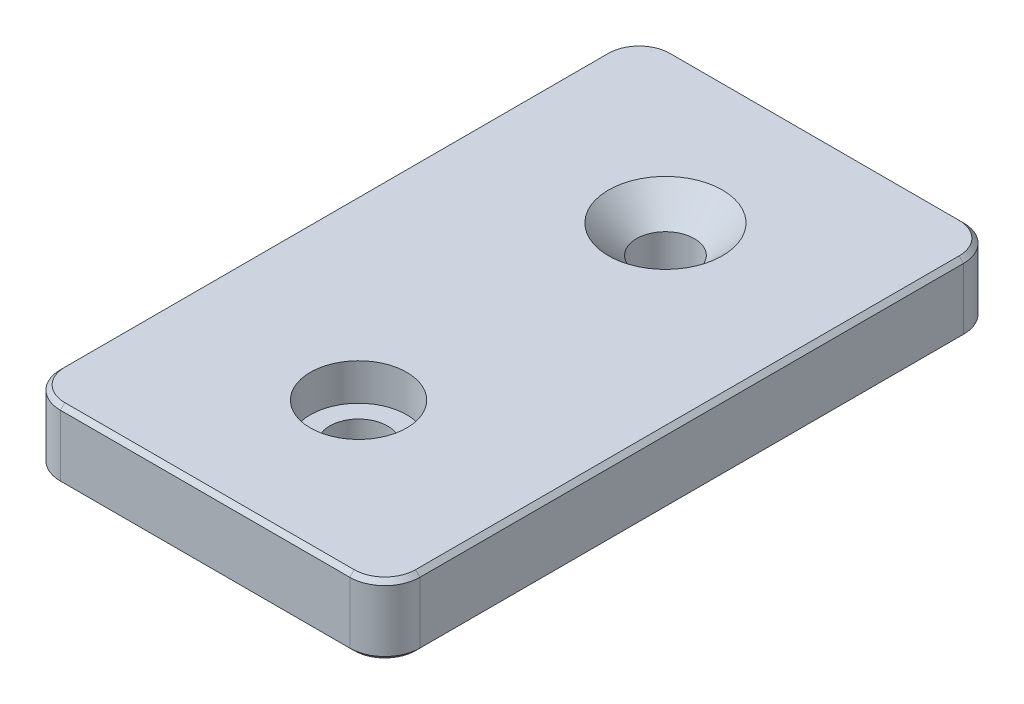
ISO-10303-21;
HEADER;
FILE_DESCRIPTION(('STEP AP214'),'2;1');
FILE_NAME('part.step','',(''),(''),'','','');
FILE_SCHEMA(('AUTOMOTIVE_DESIGN { 1 0 10303 214 1 1 1 1 }'));
ENDSEC;
DATA;
#1=APPLICATION_CONTEXT('core data for automotive mechanical design processes');
#2=APPLICATION_PROTOCOL_DEFINITION('international standard','automotive_design',2000,#1);
#3=PRODUCT_CONTEXT('',#1,'mechanical');
#4=PRODUCT('Part','Part','',(#3));
#5=PRODUCT_RELATED_PRODUCT_CATEGORY('part','',(#4));
#6=PRODUCT_DEFINITION_FORMATION('','',#4);
#7=PRODUCT_DEFINITION_CONTEXT('part definition',#1,'design');
#8=PRODUCT_DEFINITION('design','',#6,#7);
#9=PRODUCT_DEFINITION_SHAPE('','',#8);
#10=(LENGTH_UNIT() NAMED_UNIT(*) SI_UNIT(.MILLI.,.METRE.));
#11=(NAMED_UNIT(*) PLANE_ANGLE_UNIT() SI_UNIT($,.RADIAN.));
#12=(NAMED_UNIT(*) SI_UNIT($,.STERADIAN.) SOLID_ANGLE_UNIT());
#13=UNCERTAINTY_MEASURE_WITH_UNIT(LENGTH_MEASURE(1.E-05),#10,'distance_accuracy_value','');
#14=(GEOMETRIC_REPRESENTATION_CONTEXT(3) GLOBAL_UNCERTAINTY_ASSIGNED_CONTEXT((#13)) GLOBAL_UNIT_ASSIGNED_CONTEXT((#10,
#11,#12)) REPRESENTATION_CONTEXT('',''));
#15=CARTESIAN_POINT('',(0.,0.,0.));
#16=DIRECTION('',(0.,0.,1.));
#17=DIRECTION('',(1.,0.,0.));
#18=AXIS2_PLACEMENT_3D('',#15,#16,#17);
#19=CARTESIAN_POINT('',(0.,8.,17.5));
#20=DIRECTION('',(0.,-1.,0.));
#21=DIRECTION('',(0.,0.,-1.));
#22=AXIS2_PLACEMENT_3D('',#19,#20,#21);
#23=CYLINDRICAL_SURFACE('',#22,3.3);
#24=CARTESIAN_POINT('',(0.,0.,17.5));
#25=DIRECTION('',(0.,1.,0.));
#26=DIRECTION('',(0.,0.,1.));
#27=AXIS2_PLACEMENT_3D('',#24,#25,#26);
#28=CIRCLE('',#27,3.3);
#29=CARTESIAN_POINT('',(0.,0.,20.8));
#30=VERTEX_POINT('',#29);
#31=EDGE_CURVE('E452',#30,#30,#28,.T.);
#32=ORIENTED_EDGE('',*,*,#31,.F.);
#33=EDGE_LOOP('',(#32));
#34=FACE_BOUND('',#33,.T.);
#35=CARTESIAN_POINT('',(0.,3.8,17.5));
#36=DIRECTION('',(0.,1.,0.));
#37=DIRECTION('',(0.,0.,1.));
#38=AXIS2_PLACEMENT_3D('',#35,#36,#37);
#39=CIRCLE('',#38,3.3);
#40=CARTESIAN_POINT('',(0.,3.8,20.8));
#41=VERTEX_POINT('',#40);
#42=EDGE_CURVE('E448',#41,#41,#39,.T.);
#43=ORIENTED_EDGE('',*,*,#42,.T.);
#44=EDGE_LOOP('',(#43));
#45=FACE_BOUND('',#44,.T.);
#46=ADVANCED_FACE('F41',(#34,#45),#23,.F.);
#47=CARTESIAN_POINT('',(0.,8.,0.));
#48=DIRECTION('',(0.,-1.,0.));
#49=DIRECTION('',(0.,0.,-1.));
#50=AXIS2_PLACEMENT_3D('',#47,#48,#49);
#51=PLANE('',#50);
#52=CARTESIAN_POINT('',(-16.5,8.,-31.));
#53=DIRECTION('',(0.,-1.,0.));
#54=DIRECTION('',(0.,0.,-1.));
#55=AXIS2_PLACEMENT_3D('',#52,#53,#54);
#56=CIRCLE('',#55,3.50000000000001);
#57=CARTESIAN_POINT('',(-16.5,8.,-34.5));
#58=VERTEX_POINT('',#57);
#59=CARTESIAN_POINT('',(-20.,8.,-31.));
#60=VERTEX_POINT('',#59);
#61=EDGE_CURVE('E283',#58,#60,#56,.F.);
#62=ORIENTED_EDGE('',*,*,#61,.T.);
#63=DIRECTION('',(0.,0.,1.));
#64=VECTOR('',#63,1.);
#65=CARTESIAN_POINT('',(-20.,8.,0.));
#66=LINE('',#65,#64);
#67=CARTESIAN_POINT('',(-20.,8.,31.));
#68=VERTEX_POINT('',#67);
#69=EDGE_CURVE('E11',#60,#68,#66,.T.);
#70=ORIENTED_EDGE('',*,*,#69,.T.);
#71=CARTESIAN_POINT('',(-16.5,8.,31.));
#72=DIRECTION('',(0.,-1.,0.));
#73=DIRECTION('',(0.,0.,-1.));
#74=AXIS2_PLACEMENT_3D('',#71,#72,#73);
#75=CIRCLE('',#74,3.50000000000001);
#76=CARTESIAN_POINT('',(-16.5,8.,34.5));
#77=VERTEX_POINT('',#76);
#78=EDGE_CURVE('E52',#68,#77,#75,.F.);
#79=ORIENTED_EDGE('',*,*,#78,.T.);
#80=DIRECTION('',(1.,0.,0.));
#81=VECTOR('',#80,1.);
#82=CARTESIAN_POINT('',(0.,8.,34.5));
#83=LINE('',#82,#81);
#84=CARTESIAN_POINT('',(16.5,8.,34.5));
#85=VERTEX_POINT('',#84);
#86=EDGE_CURVE('E298',#77,#85,#83,.T.);
#87=ORIENTED_EDGE('',*,*,#86,.T.);
#88=CARTESIAN_POINT('',(16.5,8.,31.));
#89=DIRECTION('',(0.,-1.,0.));
#90=DIRECTION('',(0.,0.,-1.));
#91=AXIS2_PLACEMENT_3D('',#88,#89,#90);
#92=CIRCLE('',#91,3.50000000000001);
#93=CARTESIAN_POINT('',(20.,8.,31.));
#94=VERTEX_POINT('',#93);
#95=EDGE_CURVE('E295',#85,#94,#92,.F.);
#96=ORIENTED_EDGE('',*,*,#95,.T.);
#97=DIRECTION('',(0.,0.,-1.));
#98=VECTOR('',#97,1.);
#99=CARTESIAN_POINT('',(20.,8.,0.));
#100=LINE('',#99,#98);
#101=CARTESIAN_POINT('',(20.,8.,-31.));
#102=VERTEX_POINT('',#101);
#103=EDGE_CURVE('E292',#94,#102,#100,.T.);
#104=ORIENTED_EDGE('',*,*,#103,.T.);
#105=CARTESIAN_POINT('',(16.5,8.,-31.));
#106=DIRECTION('',(0.,-1.,0.));
#107=DIRECTION('',(0.,0.,-1.));
#108=AXIS2_PLACEMENT_3D('',#105,#106,#107);
#109=CIRCLE('',#108,3.50000000000001);
#110=CARTESIAN_POINT('',(16.5,8.,-34.5));
#111=VERTEX_POINT('',#110);
#112=EDGE_CURVE('E289',#102,#111,#109,.F.);
#113=ORIENTED_EDGE('',*,*,#112,.T.);
#114=DIRECTION('',(-1.,0.,0.));
#115=VECTOR('',#114,1.);
#116=CARTESIAN_POINT('',(0.,8.,-34.5));
#117=LINE('',#116,#115);
#118=EDGE_CURVE('E286',#111,#58,#117,.T.);
#119=ORIENTED_EDGE('',*,*,#118,.T.);
#120=EDGE_LOOP('',(#62,#70,#79,#87,#96,#104,#113,#119));
#121=FACE_BOUND('',#120,.T.);
#122=CARTESIAN_POINT('',(0.,8.,-17.5));
#123=DIRECTION('',(0.,-1.,0.));
#124=DIRECTION('',(0.,0.,-1.));
#125=AXIS2_PLACEMENT_3D('',#122,#123,#124);
#126=CIRCLE('',#125,6.50000000000001);
#127=CARTESIAN_POINT('',(0.,8.,-24.));
#128=VERTEX_POINT('',#127);
#129=EDGE_CURVE('E437',#128,#128,#126,.T.);
#130=ORIENTED_EDGE('',*,*,#129,.T.);
#131=EDGE_LOOP('',(#130));
#132=FACE_BOUND('',#131,.T.);
#133=CARTESIAN_POINT('',(0.,8.,17.5));
#134=DIRECTION('',(0.,1.,0.));
#135=DIRECTION('',(0.,0.,1.));
#136=AXIS2_PLACEMENT_3D('',#133,#134,#135);
#137=CIRCLE('',#136,5.5);
#138=CARTESIAN_POINT('',(0.,8.,23.));
#139=VERTEX_POINT('',#138);
#140=EDGE_CURVE('E327',#139,#139,#137,.T.);
#141=ORIENTED_EDGE('',*,*,#140,.F.);
#142=EDGE_LOOP('',(#141));
#143=FACE_BOUND('',#142,.T.);
#144=ADVANCED_FACE('F425',(#121,#132,#143),#51,.F.);
#145=CARTESIAN_POINT('',(0.,0.,0.));
#146=DIRECTION('',(0.,-1.,0.));
#147=DIRECTION('',(0.,0.,-1.));
#148=AXIS2_PLACEMENT_3D('',#145,#146,#147);
#149=PLANE('',#148);
#150=CARTESIAN_POINT('',(-16.5,0.,31.));
#151=DIRECTION('',(0.,-1.,0.));
#152=DIRECTION('',(0.,0.,-1.));
#153=AXIS2_PLACEMENT_3D('',#150,#151,#152);
#154=CIRCLE('',#153,3.5);
#155=CARTESIAN_POINT('',(-16.5,0.,34.5));
#156=VERTEX_POINT('',#155);
#157=CARTESIAN_POINT('',(-20.,0.,31.));
#158=VERTEX_POINT('',#157);
#159=EDGE_CURVE('E241',#156,#158,#154,.T.);
#160=ORIENTED_EDGE('',*,*,#159,.T.);
#161=DIRECTION('',(0.,0.,-1.));
#162=VECTOR('',#161,1.);
#163=CARTESIAN_POINT('',(-20.,0.,-31.));
#164=LINE('',#163,#162);
#165=CARTESIAN_POINT('',(-20.,0.,-31.));
#166=VERTEX_POINT('',#165);
#167=EDGE_CURVE('E165',#158,#166,#164,.T.);
#168=ORIENTED_EDGE('',*,*,#167,.T.);
#169=CARTESIAN_POINT('',(-16.5,0.,-31.));
#170=DIRECTION('',(0.,-1.,0.));
#171=DIRECTION('',(0.,0.,-1.));
#172=AXIS2_PLACEMENT_3D('',#169,#170,#171);
#173=CIRCLE('',#172,3.5);
#174=CARTESIAN_POINT('',(-16.5,0.,-34.5));
#175=VERTEX_POINT('',#174);
#176=EDGE_CURVE('E229',#166,#175,#173,.T.);
#177=ORIENTED_EDGE('',*,*,#176,.T.);
#178=DIRECTION('',(1.,0.,0.));
#179=VECTOR('',#178,1.);
#180=CARTESIAN_POINT('',(16.5,0.,-34.5));
#181=LINE('',#180,#179);
#182=CARTESIAN_POINT('',(16.5,0.,-34.5));
#183=VERTEX_POINT('',#182);
#184=EDGE_CURVE('E194',#175,#183,#181,.T.);
#185=ORIENTED_EDGE('',*,*,#184,.T.);
#186=CARTESIAN_POINT('',(16.5,0.,-31.));
#187=DIRECTION('',(0.,-1.,0.));
#188=DIRECTION('',(0.,0.,-1.));
#189=AXIS2_PLACEMENT_3D('',#186,#187,#188);
#190=CIRCLE('',#189,3.5);
#191=CARTESIAN_POINT('',(20.,0.,-31.));
#192=VERTEX_POINT('',#191);
#193=EDGE_CURVE('E226',#183,#192,#190,.T.);
#194=ORIENTED_EDGE('',*,*,#193,.T.);
#195=DIRECTION('',(0.,0.,1.));
#196=VECTOR('',#195,1.);
#197=CARTESIAN_POINT('',(20.,0.,31.));
#198=LINE('',#197,#196);
#199=CARTESIAN_POINT('',(20.,0.,31.));
#200=VERTEX_POINT('',#199);
#201=EDGE_CURVE('E232',#192,#200,#198,.T.);
#202=ORIENTED_EDGE('',*,*,#201,.T.);
#203=CARTESIAN_POINT('',(16.5,0.,31.));
#204=DIRECTION('',(0.,-1.,0.));
#205=DIRECTION('',(0.,0.,-1.));
#206=AXIS2_PLACEMENT_3D('',#203,#204,#205);
#207=CIRCLE('',#206,3.5);
#208=CARTESIAN_POINT('',(16.5,0.,34.5));
#209=VERTEX_POINT('',#208);
#210=EDGE_CURVE('E235',#200,#209,#207,.T.);
#211=ORIENTED_EDGE('',*,*,#210,.T.);
#212=DIRECTION('',(-1.,0.,0.));
#213=VECTOR('',#212,1.);
#214=CARTESIAN_POINT('',(-16.5,0.,34.5));
#215=LINE('',#214,#213);
#216=EDGE_CURVE('E238',#209,#156,#215,.T.);
#217=ORIENTED_EDGE('',*,*,#216,.T.);
#218=EDGE_LOOP('',(#160,#168,#177,#185,#194,#202,#211,#217));
#219=FACE_BOUND('',#218,.T.);
#220=CARTESIAN_POINT('',(0.,0.,-17.5));
#221=DIRECTION('',(0.,1.,0.));
#222=DIRECTION('',(0.,0.,1.));
#223=AXIS2_PLACEMENT_3D('',#220,#221,#222);
#224=CIRCLE('',#223,3.3);
#225=CARTESIAN_POINT('',(0.,0.,-14.2));
#226=VERTEX_POINT('',#225);
#227=EDGE_CURVE('E447',#226,#226,#224,.T.);
#228=ORIENTED_EDGE('',*,*,#227,.T.);
#229=EDGE_LOOP('',(#228));
#230=FACE_BOUND('',#229,.T.);
#231=ORIENTED_EDGE('',*,*,#31,.T.);
#232=EDGE_LOOP('',(#231));
#233=FACE_BOUND('',#232,.T.);
#234=ADVANCED_FACE('F387',(#219,#230,#233),#149,.T.);
#235=CARTESIAN_POINT('',(20.5,8.,35.));
#236=DIRECTION('',(-1.,0.,0.));
#237=DIRECTION('',(0.,0.,1.));
#238=AXIS2_PLACEMENT_3D('',#235,#236,#237);
#239=PLANE('',#238);
#240=DIRECTION('',(0.,-1.,0.));
#241=VECTOR('',#240,1.);
#242=CARTESIAN_POINT('',(20.5,8.,31.));
#243=LINE('',#242,#241);
#244=CARTESIAN_POINT('',(20.5,7.5,31.));
#245=VERTEX_POINT('',#244);
#246=CARTESIAN_POINT('',(20.5,0.5,31.));
#247=VERTEX_POINT('',#246);
#248=EDGE_CURVE('E205',#245,#247,#243,.T.);
#249=ORIENTED_EDGE('',*,*,#248,.T.);
#250=DIRECTION('',(0.,0.,-1.));
#251=VECTOR('',#250,1.);
#252=CARTESIAN_POINT('',(20.5,0.5,-31.));
#253=LINE('',#252,#251);
#254=CARTESIAN_POINT('',(20.5,0.5,-31.));
#255=VERTEX_POINT('',#254);
#256=EDGE_CURVE('E262',#247,#255,#253,.T.);
#257=ORIENTED_EDGE('',*,*,#256,.T.);
#258=DIRECTION('',(0.,-1.,0.));
#259=VECTOR('',#258,1.);
#260=CARTESIAN_POINT('',(20.5,8.,-31.));
#261=LINE('',#260,#259);
#262=CARTESIAN_POINT('',(20.5,7.5,-31.));
#263=VERTEX_POINT('',#262);
#264=EDGE_CURVE('E200',#255,#263,#261,.F.);
#265=ORIENTED_EDGE('',*,*,#264,.T.);
#266=DIRECTION('',(0.,0.,1.));
#267=VECTOR('',#266,1.);
#268=CARTESIAN_POINT('',(20.5,7.5,35.));
#269=LINE('',#268,#267);
#270=EDGE_CURVE('E259',#263,#245,#269,.T.);
#271=ORIENTED_EDGE('',*,*,#270,.T.);
#272=EDGE_LOOP('',(#249,#257,#265,#271));
#273=FACE_BOUND('',#272,.T.);
#274=ADVANCED_FACE('F368',(#273),#239,.F.);
#275=CARTESIAN_POINT('',(-20.5,8.,-35.));
#276=DIRECTION('',(0.,0.,1.));
#277=DIRECTION('',(1.,0.,0.));
#278=AXIS2_PLACEMENT_3D('',#275,#276,#277);
#279=PLANE('',#278);
#280=DIRECTION('',(0.,-1.,0.));
#281=VECTOR('',#280,1.);
#282=CARTESIAN_POINT('',(16.5,8.,-35.));
#283=LINE('',#282,#281);
#284=CARTESIAN_POINT('',(16.5,7.5,-35.));
#285=VERTEX_POINT('',#284);
#286=CARTESIAN_POINT('',(16.5,0.5,-35.));
#287=VERTEX_POINT('',#286);
#288=EDGE_CURVE('E218',#285,#287,#283,.T.);
#289=ORIENTED_EDGE('',*,*,#288,.T.);
#290=DIRECTION('',(-1.,0.,0.));
#291=VECTOR('',#290,1.);
#292=CARTESIAN_POINT('',(-16.5,0.5,-35.));
#293=LINE('',#292,#291);
#294=CARTESIAN_POINT('',(-16.5,0.5,-35.));
#295=VERTEX_POINT('',#294);
#296=EDGE_CURVE('E280',#287,#295,#293,.T.);
#297=ORIENTED_EDGE('',*,*,#296,.T.);
#298=DIRECTION('',(0.,-1.,0.));
#299=VECTOR('',#298,1.);
#300=CARTESIAN_POINT('',(-16.5,8.,-35.));
#301=LINE('',#300,#299);
#302=CARTESIAN_POINT('',(-16.5,7.5,-35.));
#303=VERTEX_POINT('',#302);
#304=EDGE_CURVE('E214',#295,#303,#301,.F.);
#305=ORIENTED_EDGE('',*,*,#304,.T.);
#306=DIRECTION('',(1.,0.,0.));
#307=VECTOR('',#306,1.);
#308=CARTESIAN_POINT('',(-20.5,7.5,-35.));
#309=LINE('',#308,#307);
#310=EDGE_CURVE('E277',#303,#285,#309,.T.);
#311=ORIENTED_EDGE('',*,*,#310,.T.);
#312=EDGE_LOOP('',(#289,#297,#305,#311));
#313=FACE_BOUND('',#312,.T.);
#314=ADVANCED_FACE('F400',(#313),#279,.F.);
#315=CARTESIAN_POINT('',(-20.5,8.,35.));
#316=DIRECTION('',(1.,0.,0.));
#317=DIRECTION('',(0.,0.,-1.));
#318=AXIS2_PLACEMENT_3D('',#315,#316,#317);
#319=PLANE('',#318);
#320=DIRECTION('',(0.,-1.,0.));
#321=VECTOR('',#320,1.);
#322=CARTESIAN_POINT('',(-20.5,8.,-31.));
#323=LINE('',#322,#321);
#324=CARTESIAN_POINT('',(-20.5,7.5,-31.));
#325=VERTEX_POINT('',#324);
#326=CARTESIAN_POINT('',(-20.5,0.5,-31.));
#327=VERTEX_POINT('',#326);
#328=EDGE_CURVE('E191',#325,#327,#323,.T.);
#329=ORIENTED_EDGE('',*,*,#328,.T.);
#330=DIRECTION('',(0.,0.,1.));
#331=VECTOR('',#330,1.);
#332=CARTESIAN_POINT('',(-20.5,0.5,31.));
#333=LINE('',#332,#331);
#334=CARTESIAN_POINT('',(-20.5,0.5,31.));
#335=VERTEX_POINT('',#334);
#336=EDGE_CURVE('E163',#327,#335,#333,.T.);
#337=ORIENTED_EDGE('',*,*,#336,.T.);
#338=DIRECTION('',(0.,-1.,0.));
#339=VECTOR('',#338,1.);
#340=CARTESIAN_POINT('',(-20.5,8.,31.));
#341=LINE('',#340,#339);
#342=CARTESIAN_POINT('',(-20.5,7.5,31.));
#343=VERTEX_POINT('',#342);
#344=EDGE_CURVE('E189',#335,#343,#341,.F.);
#345=ORIENTED_EDGE('',*,*,#344,.T.);
#346=DIRECTION('',(0.,0.,-1.));
#347=VECTOR('',#346,1.);
#348=CARTESIAN_POINT('',(-20.5,7.5,35.));
#349=LINE('',#348,#347);
#350=EDGE_CURVE('E195',#343,#325,#349,.T.);
#351=ORIENTED_EDGE('',*,*,#350,.T.);
#352=EDGE_LOOP('',(#329,#337,#345,#351));
#353=FACE_BOUND('',#352,.T.);
#354=ADVANCED_FACE('F187',(#353),#319,.F.);
#355=CARTESIAN_POINT('',(-20.5,8.,35.));
#356=DIRECTION('',(0.,0.,-1.));
#357=DIRECTION('',(-1.,0.,0.));
#358=AXIS2_PLACEMENT_3D('',#355,#356,#357);
#359=PLANE('',#358);
#360=DIRECTION('',(0.,-1.,0.));
#361=VECTOR('',#360,1.);
#362=CARTESIAN_POINT('',(-16.5,8.,35.));
#363=LINE('',#362,#361);
#364=CARTESIAN_POINT('',(-16.5,7.5,35.));
#365=VERTEX_POINT('',#364);
#366=CARTESIAN_POINT('',(-16.5,0.5,35.));
#367=VERTEX_POINT('',#366);
#368=EDGE_CURVE('E207',#365,#367,#363,.T.);
#369=ORIENTED_EDGE('',*,*,#368,.T.);
#370=DIRECTION('',(1.,0.,0.));
#371=VECTOR('',#370,1.);
#372=CARTESIAN_POINT('',(16.5,0.5,35.));
#373=LINE('',#372,#371);
#374=CARTESIAN_POINT('',(16.5,0.5,35.));
#375=VERTEX_POINT('',#374);
#376=EDGE_CURVE('E250',#367,#375,#373,.T.);
#377=ORIENTED_EDGE('',*,*,#376,.T.);
#378=DIRECTION('',(0.,-1.,0.));
#379=VECTOR('',#378,1.);
#380=CARTESIAN_POINT('',(16.5,8.,35.));
#381=LINE('',#380,#379);
#382=CARTESIAN_POINT('',(16.5,7.5,35.));
#383=VERTEX_POINT('',#382);
#384=EDGE_CURVE('E376',#375,#383,#381,.F.);
#385=ORIENTED_EDGE('',*,*,#384,.T.);
#386=DIRECTION('',(-1.,0.,0.));
#387=VECTOR('',#386,1.);
#388=CARTESIAN_POINT('',(-20.5,7.5,35.));
#389=LINE('',#388,#387);
#390=EDGE_CURVE('E181',#383,#365,#389,.T.);
#391=ORIENTED_EDGE('',*,*,#390,.T.);
#392=EDGE_LOOP('',(#369,#377,#385,#391));
#393=FACE_BOUND('',#392,.T.);
#394=ADVANCED_FACE('F434',(#393),#359,.F.);
#395=CARTESIAN_POINT('',(0.,8.,-17.5));
#396=DIRECTION('',(0.,-1.,0.));
#397=DIRECTION('',(0.,0.,-1.));
#398=AXIS2_PLACEMENT_3D('',#395,#396,#397);
#399=CYLINDRICAL_SURFACE('',#398,3.3);
#400=CARTESIAN_POINT('',(0.,4.80000000000001,-17.5));
#401=DIRECTION('',(0.,-1.,0.));
#402=DIRECTION('',(0.,0.,-1.));
#403=AXIS2_PLACEMENT_3D('',#400,#401,#402);
#404=CIRCLE('',#403,3.3);
#405=CARTESIAN_POINT('',(0.,4.80000000000001,-20.8));
#406=VERTEX_POINT('',#405);
#407=EDGE_CURVE('E443',#406,#406,#404,.F.);
#408=ORIENTED_EDGE('',*,*,#407,.T.);
#409=EDGE_LOOP('',(#408));
#410=FACE_BOUND('',#409,.T.);
#411=ORIENTED_EDGE('',*,*,#227,.F.);
#412=EDGE_LOOP('',(#411));
#413=FACE_BOUND('',#412,.T.);
#414=ADVANCED_FACE('F472',(#410,#413),#399,.F.);
#415=CARTESIAN_POINT('',(0.,3.8,17.5));
#416=DIRECTION('',(0.,1.,0.));
#417=DIRECTION('',(0.,0.,1.));
#418=AXIS2_PLACEMENT_3D('',#415,#416,#417);
#419=CYLINDRICAL_SURFACE('',#418,5.5);
#420=CARTESIAN_POINT('',(0.,3.8,17.5));
#421=DIRECTION('',(0.,1.,0.));
#422=DIRECTION('',(0.,0.,1.));
#423=AXIS2_PLACEMENT_3D('',#420,#421,#422);
#424=CIRCLE('',#423,5.5);
#425=CARTESIAN_POINT('',(0.,3.8,23.));
#426=VERTEX_POINT('',#425);
#427=EDGE_CURVE('E453',#426,#426,#424,.T.);
#428=ORIENTED_EDGE('',*,*,#427,.F.);
#429=EDGE_LOOP('',(#428));
#430=FACE_BOUND('',#429,.T.);
#431=ORIENTED_EDGE('',*,*,#140,.T.);
#432=EDGE_LOOP('',(#431));
#433=FACE_BOUND('',#432,.T.);
#434=ADVANCED_FACE('F469',(#430,#433),#419,.F.);
#435=CARTESIAN_POINT('',(0.,3.8,17.5));
#436=DIRECTION('',(0.,1.,0.));
#437=DIRECTION('',(0.,0.,1.));
#438=AXIS2_PLACEMENT_3D('',#435,#436,#437);
#439=PLANE('',#438);
#440=ORIENTED_EDGE('',*,*,#42,.F.);
#441=EDGE_LOOP('',(#440));
#442=FACE_BOUND('',#441,.T.);
#443=ORIENTED_EDGE('',*,*,#427,.T.);
#444=EDGE_LOOP('',(#443));
#445=FACE_BOUND('',#444,.T.);
#446=ADVANCED_FACE('F467',(#442,#445),#439,.T.);
#447=CARTESIAN_POINT('',(0.,4.80000000000001,-17.5));
#448=DIRECTION('',(0.,1.,0.));
#449=DIRECTION('',(0.,0.,1.));
#450=AXIS2_PLACEMENT_3D('',#447,#448,#449);
#451=CONICAL_SURFACE('',#450,3.3,0.785398163397451);
#452=ORIENTED_EDGE('',*,*,#129,.F.);
#453=EDGE_LOOP('',(#452));
#454=FACE_BOUND('',#453,.T.);
#455=ORIENTED_EDGE('',*,*,#407,.F.);
#456=EDGE_LOOP('',(#455));
#457=FACE_BOUND('',#456,.T.);
#458=ADVANCED_FACE('F496',(#454,#457),#451,.F.);
#459=CARTESIAN_POINT('',(-16.5,8.,31.));
#460=DIRECTION('',(0.,-1.,0.));
#461=DIRECTION('',(0.,0.,-1.));
#462=AXIS2_PLACEMENT_3D('',#459,#460,#461);
#463=CYLINDRICAL_SURFACE('',#462,4.);
#464=ORIENTED_EDGE('',*,*,#344,.F.);
#465=CARTESIAN_POINT('',(-16.5,0.5,31.));
#466=DIRECTION('',(0.,-1.,0.));
#467=DIRECTION('',(0.,0.,-1.));
#468=AXIS2_PLACEMENT_3D('',#465,#466,#467);
#469=CIRCLE('',#468,4.);
#470=EDGE_CURVE('E172',#335,#367,#469,.F.);
#471=ORIENTED_EDGE('',*,*,#470,.T.);
#472=ORIENTED_EDGE('',*,*,#368,.F.);
#473=CARTESIAN_POINT('',(-16.5,7.5,31.));
#474=DIRECTION('',(0.,-1.,0.));
#475=DIRECTION('',(0.,0.,-1.));
#476=AXIS2_PLACEMENT_3D('',#473,#474,#475);
#477=CIRCLE('',#476,4.);
#478=EDGE_CURVE('E182',#365,#343,#477,.T.);
#479=ORIENTED_EDGE('',*,*,#478,.T.);
#480=EDGE_LOOP('',(#464,#471,#472,#479));
#481=FACE_BOUND('',#480,.T.);
#482=ADVANCED_FACE('F197',(#481),#463,.T.);
#483=CARTESIAN_POINT('',(16.5,8.,31.));
#484=DIRECTION('',(0.,-1.,0.));
#485=DIRECTION('',(0.,0.,-1.));
#486=AXIS2_PLACEMENT_3D('',#483,#484,#485);
#487=CYLINDRICAL_SURFACE('',#486,4.);
#488=ORIENTED_EDGE('',*,*,#384,.F.);
#489=CARTESIAN_POINT('',(16.5,0.5,31.));
#490=DIRECTION('',(0.,-1.,0.));
#491=DIRECTION('',(0.,0.,-1.));
#492=AXIS2_PLACEMENT_3D('',#489,#490,#491);
#493=CIRCLE('',#492,4.);
#494=EDGE_CURVE('E256',#375,#247,#493,.F.);
#495=ORIENTED_EDGE('',*,*,#494,.T.);
#496=ORIENTED_EDGE('',*,*,#248,.F.);
#497=CARTESIAN_POINT('',(16.5,7.5,31.));
#498=DIRECTION('',(0.,-1.,0.));
#499=DIRECTION('',(0.,0.,-1.));
#500=AXIS2_PLACEMENT_3D('',#497,#498,#499);
#501=CIRCLE('',#500,4.);
#502=EDGE_CURVE('E253',#245,#383,#501,.T.);
#503=ORIENTED_EDGE('',*,*,#502,.T.);
#504=EDGE_LOOP('',(#488,#495,#496,#503));
#505=FACE_BOUND('',#504,.T.);
#506=ADVANCED_FACE('F373',(#505),#487,.T.);
#507=CARTESIAN_POINT('',(16.5,8.,-31.));
#508=DIRECTION('',(0.,-1.,0.));
#509=DIRECTION('',(0.,0.,-1.));
#510=AXIS2_PLACEMENT_3D('',#507,#508,#509);
#511=CYLINDRICAL_SURFACE('',#510,4.);
#512=ORIENTED_EDGE('',*,*,#264,.F.);
#513=CARTESIAN_POINT('',(16.5,0.5,-31.));
#514=DIRECTION('',(0.,-1.,0.));
#515=DIRECTION('',(0.,0.,-1.));
#516=AXIS2_PLACEMENT_3D('',#513,#514,#515);
#517=CIRCLE('',#516,4.);
#518=EDGE_CURVE('E274',#255,#287,#517,.F.);
#519=ORIENTED_EDGE('',*,*,#518,.T.);
#520=ORIENTED_EDGE('',*,*,#288,.F.);
#521=CARTESIAN_POINT('',(16.5,7.5,-31.));
#522=DIRECTION('',(0.,-1.,0.));
#523=DIRECTION('',(0.,0.,-1.));
#524=AXIS2_PLACEMENT_3D('',#521,#522,#523);
#525=CIRCLE('',#524,4.);
#526=EDGE_CURVE('E271',#285,#263,#525,.T.);
#527=ORIENTED_EDGE('',*,*,#526,.T.);
#528=EDGE_LOOP('',(#512,#519,#520,#527));
#529=FACE_BOUND('',#528,.T.);
#530=ADVANCED_FACE('F396',(#529),#511,.T.);
#531=CARTESIAN_POINT('',(-16.5,8.,-31.));
#532=DIRECTION('',(0.,-1.,0.));
#533=DIRECTION('',(0.,0.,-1.));
#534=AXIS2_PLACEMENT_3D('',#531,#532,#533);
#535=CYLINDRICAL_SURFACE('',#534,4.);
#536=ORIENTED_EDGE('',*,*,#304,.F.);
#537=CARTESIAN_POINT('',(-16.5,0.5,-31.));
#538=DIRECTION('',(0.,-1.,0.));
#539=DIRECTION('',(0.,0.,-1.));
#540=AXIS2_PLACEMENT_3D('',#537,#538,#539);
#541=CIRCLE('',#540,4.);
#542=EDGE_CURVE('E268',#295,#327,#541,.F.);
#543=ORIENTED_EDGE('',*,*,#542,.T.);
#544=ORIENTED_EDGE('',*,*,#328,.F.);
#545=CARTESIAN_POINT('',(-16.5,7.5,-31.));
#546=DIRECTION('',(0.,-1.,0.));
#547=DIRECTION('',(0.,0.,-1.));
#548=AXIS2_PLACEMENT_3D('',#545,#546,#547);
#549=CIRCLE('',#548,4.);
#550=EDGE_CURVE('E265',#325,#303,#549,.T.);
#551=ORIENTED_EDGE('',*,*,#550,.T.);
#552=EDGE_LOOP('',(#536,#543,#544,#551));
#553=FACE_BOUND('',#552,.T.);
#554=ADVANCED_FACE('F415',(#553),#535,.T.);
#555=CARTESIAN_POINT('',(20.5,0.5,35.));
#556=DIRECTION('',(0.707106781186547,-0.707106781186547,0.));
#557=DIRECTION('',(0.,0.,1.));
#558=AXIS2_PLACEMENT_3D('',#555,#556,#557);
#559=PLANE('',#558);
#560=DIRECTION('',(0.707106781186547,0.707106781186547,0.));
#561=VECTOR('',#560,1.);
#562=CARTESIAN_POINT('',(20.,0.,31.));
#563=LINE('',#562,#561);
#564=EDGE_CURVE('E319',#200,#247,#563,.T.);
#565=ORIENTED_EDGE('',*,*,#564,.F.);
#566=ORIENTED_EDGE('',*,*,#201,.F.);
#567=DIRECTION('',(-0.707106781186547,-0.707106781186547,0.));
#568=VECTOR('',#567,1.);
#569=CARTESIAN_POINT('',(20.5,0.5,-31.));
#570=LINE('',#569,#568);
#571=EDGE_CURVE('E323',#255,#192,#570,.T.);
#572=ORIENTED_EDGE('',*,*,#571,.F.);
#573=ORIENTED_EDGE('',*,*,#256,.F.);
#574=EDGE_LOOP('',(#565,#566,#572,#573));
#575=FACE_BOUND('',#574,.T.);
#576=ADVANCED_FACE('F393',(#575),#559,.T.);
#577=CARTESIAN_POINT('',(16.5,0.,-31.));
#578=DIRECTION('',(0.,1.,0.));
#579=DIRECTION('',(0.,0.,1.));
#580=AXIS2_PLACEMENT_3D('',#577,#578,#579);
#581=CONICAL_SURFACE('',#580,3.5,0.785398163397448);
#582=ORIENTED_EDGE('',*,*,#571,.T.);
#583=ORIENTED_EDGE('',*,*,#193,.F.);
#584=DIRECTION('',(0.,-0.707106781186547,0.707106781186547));
#585=VECTOR('',#584,1.);
#586=CARTESIAN_POINT('',(16.5,0.5,-35.));
#587=LINE('',#586,#585);
#588=EDGE_CURVE('E315',#287,#183,#587,.T.);
#589=ORIENTED_EDGE('',*,*,#588,.F.);
#590=ORIENTED_EDGE('',*,*,#518,.F.);
#591=EDGE_LOOP('',(#582,#583,#589,#590));
#592=FACE_BOUND('',#591,.T.);
#593=ADVANCED_FACE('F405',(#592),#581,.T.);
#594=CARTESIAN_POINT('',(16.5,0.,31.));
#595=DIRECTION('',(0.,1.,0.));
#596=DIRECTION('',(0.,0.,1.));
#597=AXIS2_PLACEMENT_3D('',#594,#595,#596);
#598=CONICAL_SURFACE('',#597,3.5,0.785398163397448);
#599=ORIENTED_EDGE('',*,*,#564,.T.);
#600=ORIENTED_EDGE('',*,*,#494,.F.);
#601=DIRECTION('',(0.,0.707106781186547,0.707106781186547));
#602=VECTOR('',#601,1.);
#603=CARTESIAN_POINT('',(16.5,0.,34.5));
#604=LINE('',#603,#602);
#605=EDGE_CURVE('E311',#209,#375,#604,.T.);
#606=ORIENTED_EDGE('',*,*,#605,.F.);
#607=ORIENTED_EDGE('',*,*,#210,.F.);
#608=EDGE_LOOP('',(#599,#600,#606,#607));
#609=FACE_BOUND('',#608,.T.);
#610=ADVANCED_FACE('F379',(#609),#598,.T.);
#611=CARTESIAN_POINT('',(-20.5,0.5,-35.));
#612=DIRECTION('',(0.,-0.707106781186547,-0.707106781186547));
#613=DIRECTION('',(1.,0.,0.));
#614=AXIS2_PLACEMENT_3D('',#611,#612,#613);
#615=PLANE('',#614);
#616=ORIENTED_EDGE('',*,*,#588,.T.);
#617=ORIENTED_EDGE('',*,*,#184,.F.);
#618=DIRECTION('',(0.,-0.707106781186547,0.707106781186547));
#619=VECTOR('',#618,1.);
#620=CARTESIAN_POINT('',(-16.5,0.5,-35.));
#621=LINE('',#620,#619);
#622=EDGE_CURVE('E307',#295,#175,#621,.T.);
#623=ORIENTED_EDGE('',*,*,#622,.F.);
#624=ORIENTED_EDGE('',*,*,#296,.F.);
#625=EDGE_LOOP('',(#616,#617,#623,#624));
#626=FACE_BOUND('',#625,.T.);
#627=ADVANCED_FACE('F409',(#626),#615,.T.);
#628=CARTESIAN_POINT('',(-20.5,0.5,35.));
#629=DIRECTION('',(0.,-0.707106781186547,0.707106781186547));
#630=DIRECTION('',(-1.,0.,0.));
#631=AXIS2_PLACEMENT_3D('',#628,#629,#630);
#632=PLANE('',#631);
#633=ORIENTED_EDGE('',*,*,#605,.T.);
#634=ORIENTED_EDGE('',*,*,#376,.F.);
#635=DIRECTION('',(0.,0.707106781186547,0.707106781186547));
#636=VECTOR('',#635,1.);
#637=CARTESIAN_POINT('',(-16.5,0.,34.5));
#638=LINE('',#637,#636);
#639=EDGE_CURVE('E175',#156,#367,#638,.T.);
#640=ORIENTED_EDGE('',*,*,#639,.F.);
#641=ORIENTED_EDGE('',*,*,#216,.F.);
#642=EDGE_LOOP('',(#633,#634,#640,#641));
#643=FACE_BOUND('',#642,.T.);
#644=ADVANCED_FACE('F385',(#643),#632,.T.);
#645=CARTESIAN_POINT('',(-16.5,0.,-31.));
#646=DIRECTION('',(0.,1.,0.));
#647=DIRECTION('',(0.,0.,1.));
#648=AXIS2_PLACEMENT_3D('',#645,#646,#647);
#649=CONICAL_SURFACE('',#648,3.5,0.785398163397448);
#650=ORIENTED_EDGE('',*,*,#622,.T.);
#651=ORIENTED_EDGE('',*,*,#176,.F.);
#652=DIRECTION('',(0.70710678118655,-0.707106781186545,0.));
#653=VECTOR('',#652,1.);
#654=CARTESIAN_POINT('',(-20.5,0.5,-31.));
#655=LINE('',#654,#653);
#656=EDGE_CURVE('E169',#327,#166,#655,.T.);
#657=ORIENTED_EDGE('',*,*,#656,.F.);
#658=ORIENTED_EDGE('',*,*,#542,.F.);
#659=EDGE_LOOP('',(#650,#651,#657,#658));
#660=FACE_BOUND('',#659,.T.);
#661=ADVANCED_FACE('F413',(#660),#649,.T.);
#662=CARTESIAN_POINT('',(-16.5,0.,31.));
#663=DIRECTION('',(0.,1.,0.));
#664=DIRECTION('',(0.,0.,1.));
#665=AXIS2_PLACEMENT_3D('',#662,#663,#664);
#666=CONICAL_SURFACE('',#665,3.5,0.785398163397448);
#667=ORIENTED_EDGE('',*,*,#639,.T.);
#668=ORIENTED_EDGE('',*,*,#470,.F.);
#669=DIRECTION('',(-0.707106781186547,0.707106781186547,0.));
#670=VECTOR('',#669,1.);
#671=CARTESIAN_POINT('',(-20.,0.,31.));
#672=LINE('',#671,#670);
#673=EDGE_CURVE('E159',#158,#335,#672,.T.);
#674=ORIENTED_EDGE('',*,*,#673,.F.);
#675=ORIENTED_EDGE('',*,*,#159,.F.);
#676=EDGE_LOOP('',(#667,#668,#674,#675));
#677=FACE_BOUND('',#676,.T.);
#678=ADVANCED_FACE('F173',(#677),#666,.T.);
#679=CARTESIAN_POINT('',(-20.5,0.5,35.));
#680=DIRECTION('',(-0.707106781186547,-0.707106781186547,0.));
#681=DIRECTION('',(0.,0.,-1.));
#682=AXIS2_PLACEMENT_3D('',#679,#680,#681);
#683=PLANE('',#682);
#684=ORIENTED_EDGE('',*,*,#656,.T.);
#685=ORIENTED_EDGE('',*,*,#167,.F.);
#686=ORIENTED_EDGE('',*,*,#673,.T.);
#687=ORIENTED_EDGE('',*,*,#336,.F.);
#688=EDGE_LOOP('',(#684,#685,#686,#687));
#689=FACE_BOUND('',#688,.T.);
#690=ADVANCED_FACE('F161',(#689),#683,.T.);
#691=CARTESIAN_POINT('',(20.,8.,0.));
#692=DIRECTION('',(-0.707106781186552,-0.707106781186543,0.));
#693=DIRECTION('',(0.,0.,-1.));
#694=AXIS2_PLACEMENT_3D('',#691,#692,#693);
#695=PLANE('',#694);
#696=DIRECTION('',(-0.707106781186543,0.707106781186552,0.));
#697=VECTOR('',#696,1.);
#698=CARTESIAN_POINT('',(20.5,7.5,31.));
#699=LINE('',#698,#697);
#700=EDGE_CURVE('E348',#245,#94,#699,.T.);
#701=ORIENTED_EDGE('',*,*,#700,.F.);
#702=ORIENTED_EDGE('',*,*,#270,.F.);
#703=DIRECTION('',(0.707106781186543,-0.707106781186552,0.));
#704=VECTOR('',#703,1.);
#705=CARTESIAN_POINT('',(20.,8.,-31.));
#706=LINE('',#705,#704);
#707=EDGE_CURVE('E46',#102,#263,#706,.T.);
#708=ORIENTED_EDGE('',*,*,#707,.F.);
#709=ORIENTED_EDGE('',*,*,#103,.F.);
#710=EDGE_LOOP('',(#701,#702,#708,#709));
#711=FACE_BOUND('',#710,.T.);
#712=ADVANCED_FACE('F44',(#711),#695,.F.);
#713=CARTESIAN_POINT('',(16.5,8.,-31.));
#714=DIRECTION('',(0.,-1.,0.));
#715=DIRECTION('',(0.,0.,-1.));
#716=AXIS2_PLACEMENT_3D('',#713,#714,#715);
#717=CONICAL_SURFACE('',#716,3.50000000000001,0.785398163397445);
#718=ORIENTED_EDGE('',*,*,#707,.T.);
#719=ORIENTED_EDGE('',*,*,#526,.F.);
#720=DIRECTION('',(0.,-0.70710678118655,-0.707106781186545));
#721=VECTOR('',#720,1.);
#722=CARTESIAN_POINT('',(16.5,8.,-34.5));
#723=LINE('',#722,#721);
#724=EDGE_CURVE('E345',#111,#285,#723,.T.);
#725=ORIENTED_EDGE('',*,*,#724,.F.);
#726=ORIENTED_EDGE('',*,*,#112,.F.);
#727=EDGE_LOOP('',(#718,#719,#725,#726));
#728=FACE_BOUND('',#727,.T.);
#729=ADVANCED_FACE('F361',(#728),#717,.T.);
#730=CARTESIAN_POINT('',(16.5,8.,31.));
#731=DIRECTION('',(0.,-1.,0.));
#732=DIRECTION('',(0.,0.,-1.));
#733=AXIS2_PLACEMENT_3D('',#730,#731,#732);
#734=CONICAL_SURFACE('',#733,3.50000000000001,0.785398163397441);
#735=ORIENTED_EDGE('',*,*,#700,.T.);
#736=ORIENTED_EDGE('',*,*,#95,.F.);
#737=DIRECTION('',(0.,0.70710678118655,-0.707106781186545));
#738=VECTOR('',#737,1.);
#739=CARTESIAN_POINT('',(16.5,7.5,35.));
#740=LINE('',#739,#738);
#741=EDGE_CURVE('E341',#383,#85,#740,.T.);
#742=ORIENTED_EDGE('',*,*,#741,.F.);
#743=ORIENTED_EDGE('',*,*,#502,.F.);
#744=EDGE_LOOP('',(#735,#736,#742,#743));
#745=FACE_BOUND('',#744,.T.);
#746=ADVANCED_FACE('F428',(#745),#734,.T.);
#747=CARTESIAN_POINT('',(0.,8.,-34.5));
#748=DIRECTION('',(0.,-0.707106781186545,0.70710678118655));
#749=DIRECTION('',(-1.,0.,0.));
#750=AXIS2_PLACEMENT_3D('',#747,#748,#749);
#751=PLANE('',#750);
#752=ORIENTED_EDGE('',*,*,#724,.T.);
#753=ORIENTED_EDGE('',*,*,#310,.F.);
#754=DIRECTION('',(0.,-0.70710678118655,-0.707106781186545));
#755=VECTOR('',#754,1.);
#756=CARTESIAN_POINT('',(-16.5,8.,-34.5));
#757=LINE('',#756,#755);
#758=EDGE_CURVE('E337',#58,#303,#757,.T.);
#759=ORIENTED_EDGE('',*,*,#758,.F.);
#760=ORIENTED_EDGE('',*,*,#118,.F.);
#761=EDGE_LOOP('',(#752,#753,#759,#760));
#762=FACE_BOUND('',#761,.T.);
#763=ADVANCED_FACE('F419',(#762),#751,.F.);
#764=CARTESIAN_POINT('',(0.,8.,34.5));
#765=DIRECTION('',(0.,-0.707106781186545,-0.70710678118655));
#766=DIRECTION('',(1.,0.,0.));
#767=AXIS2_PLACEMENT_3D('',#764,#765,#766);
#768=PLANE('',#767);
#769=ORIENTED_EDGE('',*,*,#741,.T.);
#770=ORIENTED_EDGE('',*,*,#86,.F.);
#771=DIRECTION('',(0.,0.70710678118655,-0.707106781186545));
#772=VECTOR('',#771,1.);
#773=CARTESIAN_POINT('',(-16.5,7.5,35.));
#774=LINE('',#773,#772);
#775=EDGE_CURVE('E333',#365,#77,#774,.T.);
#776=ORIENTED_EDGE('',*,*,#775,.F.);
#777=ORIENTED_EDGE('',*,*,#390,.F.);
#778=EDGE_LOOP('',(#769,#770,#776,#777));
#779=FACE_BOUND('',#778,.T.);
#780=ADVANCED_FACE('F431',(#779),#768,.F.);
#781=CARTESIAN_POINT('',(-16.5,8.,-31.));
#782=DIRECTION('',(0.,-1.,0.));
#783=DIRECTION('',(0.,0.,-1.));
#784=AXIS2_PLACEMENT_3D('',#781,#782,#783);
#785=CONICAL_SURFACE('',#784,3.50000000000001,0.785398163397441);
#786=ORIENTED_EDGE('',*,*,#758,.T.);
#787=ORIENTED_EDGE('',*,*,#550,.F.);
#788=DIRECTION('',(-0.707106781186543,-0.707106781186552,0.));
#789=VECTOR('',#788,1.);
#790=CARTESIAN_POINT('',(-20.,8.,-31.));
#791=LINE('',#790,#789);
#792=EDGE_CURVE('E330',#60,#325,#791,.T.);
#793=ORIENTED_EDGE('',*,*,#792,.F.);
#794=ORIENTED_EDGE('',*,*,#61,.F.);
#795=EDGE_LOOP('',(#786,#787,#793,#794));
#796=FACE_BOUND('',#795,.T.);
#797=ADVANCED_FACE('F423',(#796),#785,.T.);
#798=CARTESIAN_POINT('',(-16.5,8.,31.));
#799=DIRECTION('',(0.,-1.,0.));
#800=DIRECTION('',(0.,0.,-1.));
#801=AXIS2_PLACEMENT_3D('',#798,#799,#800);
#802=CONICAL_SURFACE('',#801,3.50000000000001,0.785398163397445);
#803=ORIENTED_EDGE('',*,*,#775,.T.);
#804=ORIENTED_EDGE('',*,*,#78,.F.);
#805=DIRECTION('',(0.707106781186545,0.70710678118655,0.));
#806=VECTOR('',#805,1.);
#807=CARTESIAN_POINT('',(-20.5,7.5,31.));
#808=LINE('',#807,#806);
#809=EDGE_CURVE('E60',#343,#68,#808,.T.);
#810=ORIENTED_EDGE('',*,*,#809,.F.);
#811=ORIENTED_EDGE('',*,*,#478,.F.);
#812=EDGE_LOOP('',(#803,#804,#810,#811));
#813=FACE_BOUND('',#812,.T.);
#814=ADVANCED_FACE('F557',(#813),#802,.T.);
#815=CARTESIAN_POINT('',(-20.,8.,0.));
#816=DIRECTION('',(0.707106781186552,-0.707106781186543,0.));
#817=DIRECTION('',(0.,0.,1.));
#818=AXIS2_PLACEMENT_3D('',#815,#816,#817);
#819=PLANE('',#818);
#820=ORIENTED_EDGE('',*,*,#792,.T.);
#821=ORIENTED_EDGE('',*,*,#350,.F.);
#822=ORIENTED_EDGE('',*,*,#809,.T.);
#823=ORIENTED_EDGE('',*,*,#69,.F.);
#824=EDGE_LOOP('',(#820,#821,#822,#823));
#825=FACE_BOUND('',#824,.T.);
#826=ADVANCED_FACE('F551',(#825),#819,.F.);
#827=CLOSED_SHELL('',(#46,#144,#234,#274,#314,#354,#394,#414,#434,#446,#458,#482,#506,#530,#554,
#576,#593,#610,#627,#644,#661,#678,#690,#712,#729,#746,#763,#780,#797,#814,#826));
#828=MANIFOLD_SOLID_BREP('B2',#827);
#829=ADVANCED_BREP_SHAPE_REPRESENTATION('',(#18,#828),#14);
#830=SHAPE_DEFINITION_REPRESENTATION(#9,#829);
ENDSEC;
END-ISO-10303-21;
